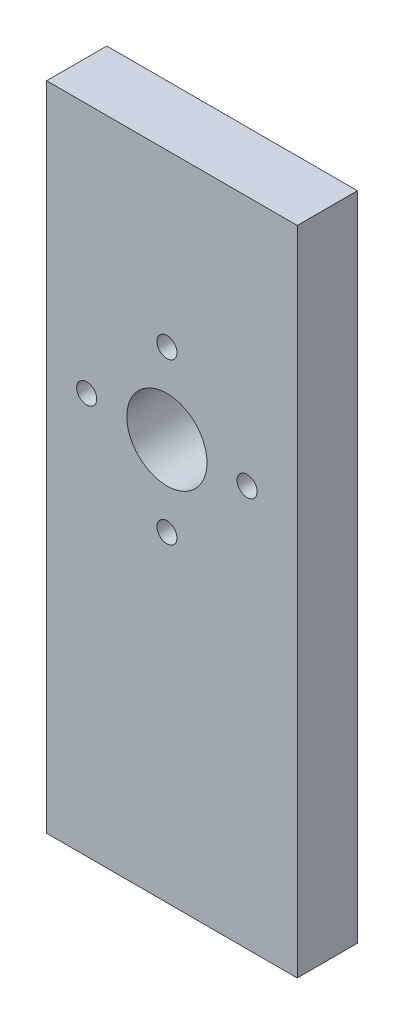
ISO-10303-21;
HEADER;
FILE_DESCRIPTION(('STEP AP214'),'2;1');
FILE_NAME('part.step','',(''),(''),'','','');
FILE_SCHEMA(('AUTOMOTIVE_DESIGN { 1 0 10303 214 1 1 1 1 }'));
ENDSEC;
DATA;
#1=APPLICATION_CONTEXT('core data for automotive mechanical design processes');
#2=APPLICATION_PROTOCOL_DEFINITION('international standard','automotive_design',2000,#1);
#3=PRODUCT_CONTEXT('',#1,'mechanical');
#4=PRODUCT('Part','Part','',(#3));
#5=PRODUCT_RELATED_PRODUCT_CATEGORY('part','',(#4));
#6=PRODUCT_DEFINITION_FORMATION('','',#4);
#7=PRODUCT_DEFINITION_CONTEXT('part definition',#1,'design');
#8=PRODUCT_DEFINITION('design','',#6,#7);
#9=PRODUCT_DEFINITION_SHAPE('','',#8);
#10=(LENGTH_UNIT() NAMED_UNIT(*) SI_UNIT(.MILLI.,.METRE.));
#11=(NAMED_UNIT(*) PLANE_ANGLE_UNIT() SI_UNIT($,.RADIAN.));
#12=(NAMED_UNIT(*) SI_UNIT($,.STERADIAN.) SOLID_ANGLE_UNIT());
#13=UNCERTAINTY_MEASURE_WITH_UNIT(LENGTH_MEASURE(1.E-05),#10,'distance_accuracy_value','');
#14=(GEOMETRIC_REPRESENTATION_CONTEXT(3) GLOBAL_UNCERTAINTY_ASSIGNED_CONTEXT((#13)) GLOBAL_UNIT_ASSIGNED_CONTEXT((#10,
#11,#12)) REPRESENTATION_CONTEXT('',''));
#15=CARTESIAN_POINT('',(0.,0.,0.));
#16=DIRECTION('',(0.,0.,1.));
#17=DIRECTION('',(1.,0.,0.));
#18=AXIS2_PLACEMENT_3D('',#15,#16,#17);
#19=CARTESIAN_POINT('',(0.,0.,6.));
#20=DIRECTION('',(0.,0.,-1.));
#21=DIRECTION('',(-1.,0.,0.));
#22=AXIS2_PLACEMENT_3D('',#19,#20,#21);
#23=PLANE('',#22);
#24=DIRECTION('',(1.,0.,0.));
#25=VECTOR('',#24,1.);
#26=CARTESIAN_POINT('',(50.3645680316484,-115.670745263183,6.));
#27=LINE('',#26,#25);
#28=CARTESIAN_POINT('',(25.3645680316484,-115.670745263183,6.));
#29=VERTEX_POINT('',#28);
#30=CARTESIAN_POINT('',(50.3645680316484,-115.670745263183,6.));
#31=VERTEX_POINT('',#30);
#32=EDGE_CURVE('E85',#29,#31,#27,.T.);
#33=ORIENTED_EDGE('',*,*,#32,.T.);
#34=DIRECTION('',(0.,1.,0.));
#35=VECTOR('',#34,1.);
#36=CARTESIAN_POINT('',(50.3645680316484,-50.6707452631834,6.));
#37=LINE('',#36,#35);
#38=CARTESIAN_POINT('',(50.3645680316484,-50.6707452631834,6.));
#39=VERTEX_POINT('',#38);
#40=EDGE_CURVE('E80',#31,#39,#37,.T.);
#41=ORIENTED_EDGE('',*,*,#40,.T.);
#42=DIRECTION('',(-1.,0.,0.));
#43=VECTOR('',#42,1.);
#44=CARTESIAN_POINT('',(50.3645680316484,-50.6707452631834,6.));
#45=LINE('',#44,#43);
#46=CARTESIAN_POINT('',(25.3645680316484,-50.6707452631833,6.));
#47=VERTEX_POINT('',#46);
#48=EDGE_CURVE('E83',#39,#47,#45,.T.);
#49=ORIENTED_EDGE('',*,*,#48,.T.);
#50=DIRECTION('',(0.,-1.,0.));
#51=VECTOR('',#50,1.);
#52=CARTESIAN_POINT('',(25.3645680316484,-115.670745263183,6.));
#53=LINE('',#52,#51);
#54=EDGE_CURVE('E50',#47,#29,#53,.T.);
#55=ORIENTED_EDGE('',*,*,#54,.T.);
#56=EDGE_LOOP('',(#33,#41,#49,#55));
#57=FACE_BOUND('',#56,.T.);
#58=CARTESIAN_POINT('',(29.3645680316484,-75.6707452631833,6.));
#59=DIRECTION('',(0.,0.,1.));
#60=DIRECTION('',(1.,0.,0.));
#61=AXIS2_PLACEMENT_3D('',#58,#59,#60);
#62=CIRCLE('',#61,1.);
#63=CARTESIAN_POINT('',(30.3645680316484,-75.6707452631833,6.));
#64=VERTEX_POINT('',#63);
#65=EDGE_CURVE('E100',#64,#64,#62,.T.);
#66=ORIENTED_EDGE('',*,*,#65,.F.);
#67=EDGE_LOOP('',(#66));
#68=FACE_BOUND('',#67,.T.);
#69=CARTESIAN_POINT('',(37.3645680316484,-67.6707452631833,6.));
#70=DIRECTION('',(0.,0.,1.));
#71=DIRECTION('',(1.,0.,0.));
#72=AXIS2_PLACEMENT_3D('',#69,#70,#71);
#73=CIRCLE('',#72,0.999999999999998);
#74=CARTESIAN_POINT('',(38.3645680316484,-67.6707452631833,6.));
#75=VERTEX_POINT('',#74);
#76=EDGE_CURVE('E115',#75,#75,#73,.T.);
#77=ORIENTED_EDGE('',*,*,#76,.F.);
#78=EDGE_LOOP('',(#77));
#79=FACE_BOUND('',#78,.T.);
#80=CARTESIAN_POINT('',(45.3645680316484,-75.6707452631833,6.));
#81=DIRECTION('',(0.,0.,1.));
#82=DIRECTION('',(1.,0.,0.));
#83=AXIS2_PLACEMENT_3D('',#80,#81,#82);
#84=CIRCLE('',#83,0.999999999999998);
#85=CARTESIAN_POINT('',(46.3645680316484,-75.6707452631833,6.));
#86=VERTEX_POINT('',#85);
#87=EDGE_CURVE('E121',#86,#86,#84,.T.);
#88=ORIENTED_EDGE('',*,*,#87,.F.);
#89=EDGE_LOOP('',(#88));
#90=FACE_BOUND('',#89,.T.);
#91=CARTESIAN_POINT('',(37.3645680316484,-83.6707452631834,6.));
#92=DIRECTION('',(0.,0.,1.));
#93=DIRECTION('',(1.,0.,0.));
#94=AXIS2_PLACEMENT_3D('',#91,#92,#93);
#95=CIRCLE('',#94,0.999999999999998);
#96=CARTESIAN_POINT('',(38.3645680316484,-83.6707452631834,6.));
#97=VERTEX_POINT('',#96);
#98=EDGE_CURVE('E127',#97,#97,#95,.T.);
#99=ORIENTED_EDGE('',*,*,#98,.F.);
#100=EDGE_LOOP('',(#99));
#101=FACE_BOUND('',#100,.T.);
#102=CARTESIAN_POINT('',(37.3645680316484,-75.6707452631833,6.));
#103=DIRECTION('',(0.,0.,1.));
#104=DIRECTION('',(1.,0.,0.));
#105=AXIS2_PLACEMENT_3D('',#102,#103,#104);
#106=CIRCLE('',#105,4.00000000000001);
#107=CARTESIAN_POINT('',(41.3645680316484,-75.6707452631833,6.));
#108=VERTEX_POINT('',#107);
#109=EDGE_CURVE('E133',#108,#108,#106,.T.);
#110=ORIENTED_EDGE('',*,*,#109,.F.);
#111=EDGE_LOOP('',(#110));
#112=FACE_BOUND('',#111,.T.);
#113=ADVANCED_FACE('F33',(#57,#68,#79,#90,#101,#112),#23,.F.);
#114=CARTESIAN_POINT('',(0.,0.,0.));
#115=DIRECTION('',(0.,0.,-1.));
#116=DIRECTION('',(-1.,0.,0.));
#117=AXIS2_PLACEMENT_3D('',#114,#115,#116);
#118=PLANE('',#117);
#119=CARTESIAN_POINT('',(37.3645680316484,-83.6707452631834,0.));
#120=DIRECTION('',(0.,0.,1.));
#121=DIRECTION('',(1.,0.,0.));
#122=AXIS2_PLACEMENT_3D('',#119,#120,#121);
#123=CIRCLE('',#122,0.999999999999998);
#124=CARTESIAN_POINT('',(38.3645680316484,-83.6707452631834,0.));
#125=VERTEX_POINT('',#124);
#126=EDGE_CURVE('E130',#125,#125,#123,.T.);
#127=ORIENTED_EDGE('',*,*,#126,.T.);
#128=EDGE_LOOP('',(#127));
#129=FACE_BOUND('',#128,.T.);
#130=CARTESIAN_POINT('',(37.3645680316484,-67.6707452631833,0.));
#131=DIRECTION('',(0.,0.,1.));
#132=DIRECTION('',(1.,0.,0.));
#133=AXIS2_PLACEMENT_3D('',#130,#131,#132);
#134=CIRCLE('',#133,0.999999999999998);
#135=CARTESIAN_POINT('',(38.3645680316484,-67.6707452631833,0.));
#136=VERTEX_POINT('',#135);
#137=EDGE_CURVE('E118',#136,#136,#134,.T.);
#138=ORIENTED_EDGE('',*,*,#137,.T.);
#139=EDGE_LOOP('',(#138));
#140=FACE_BOUND('',#139,.T.);
#141=DIRECTION('',(1.,0.,0.));
#142=VECTOR('',#141,1.);
#143=CARTESIAN_POINT('',(50.3645680316484,-115.670745263183,0.));
#144=LINE('',#143,#142);
#145=CARTESIAN_POINT('',(25.3645680316484,-115.670745263183,0.));
#146=VERTEX_POINT('',#145);
#147=CARTESIAN_POINT('',(50.3645680316484,-115.670745263183,0.));
#148=VERTEX_POINT('',#147);
#149=EDGE_CURVE('E97',#146,#148,#144,.T.);
#150=ORIENTED_EDGE('',*,*,#149,.F.);
#151=DIRECTION('',(0.,-1.,0.));
#152=VECTOR('',#151,1.);
#153=CARTESIAN_POINT('',(25.3645680316484,-115.670745263183,0.));
#154=LINE('',#153,#152);
#155=CARTESIAN_POINT('',(25.3645680316484,-50.6707452631833,0.));
#156=VERTEX_POINT('',#155);
#157=EDGE_CURVE('E73',#156,#146,#154,.T.);
#158=ORIENTED_EDGE('',*,*,#157,.F.);
#159=DIRECTION('',(-1.,0.,0.));
#160=VECTOR('',#159,1.);
#161=CARTESIAN_POINT('',(50.3645680316484,-50.6707452631834,0.));
#162=LINE('',#161,#160);
#163=CARTESIAN_POINT('',(50.3645680316484,-50.6707452631834,0.));
#164=VERTEX_POINT('',#163);
#165=EDGE_CURVE('E67',#164,#156,#162,.T.);
#166=ORIENTED_EDGE('',*,*,#165,.F.);
#167=DIRECTION('',(0.,1.,0.));
#168=VECTOR('',#167,1.);
#169=CARTESIAN_POINT('',(50.3645680316484,-50.6707452631834,0.));
#170=LINE('',#169,#168);
#171=EDGE_CURVE('E89',#148,#164,#170,.T.);
#172=ORIENTED_EDGE('',*,*,#171,.F.);
#173=EDGE_LOOP('',(#150,#158,#166,#172));
#174=FACE_BOUND('',#173,.T.);
#175=CARTESIAN_POINT('',(29.3645680316484,-75.6707452631833,0.));
#176=DIRECTION('',(0.,0.,1.));
#177=DIRECTION('',(1.,0.,0.));
#178=AXIS2_PLACEMENT_3D('',#175,#176,#177);
#179=CIRCLE('',#178,1.);
#180=CARTESIAN_POINT('',(30.3645680316484,-75.6707452631833,0.));
#181=VERTEX_POINT('',#180);
#182=EDGE_CURVE('E112',#181,#181,#179,.T.);
#183=ORIENTED_EDGE('',*,*,#182,.T.);
#184=EDGE_LOOP('',(#183));
#185=FACE_BOUND('',#184,.T.);
#186=CARTESIAN_POINT('',(45.3645680316484,-75.6707452631833,0.));
#187=DIRECTION('',(0.,0.,1.));
#188=DIRECTION('',(1.,0.,0.));
#189=AXIS2_PLACEMENT_3D('',#186,#187,#188);
#190=CIRCLE('',#189,0.999999999999998);
#191=CARTESIAN_POINT('',(46.3645680316484,-75.6707452631833,0.));
#192=VERTEX_POINT('',#191);
#193=EDGE_CURVE('E124',#192,#192,#190,.T.);
#194=ORIENTED_EDGE('',*,*,#193,.T.);
#195=EDGE_LOOP('',(#194));
#196=FACE_BOUND('',#195,.T.);
#197=CARTESIAN_POINT('',(37.3645680316484,-75.6707452631833,0.));
#198=DIRECTION('',(0.,0.,1.));
#199=DIRECTION('',(1.,0.,0.));
#200=AXIS2_PLACEMENT_3D('',#197,#198,#199);
#201=CIRCLE('',#200,4.00000000000001);
#202=CARTESIAN_POINT('',(41.3645680316484,-75.6707452631833,0.));
#203=VERTEX_POINT('',#202);
#204=EDGE_CURVE('E136',#203,#203,#201,.T.);
#205=ORIENTED_EDGE('',*,*,#204,.T.);
#206=EDGE_LOOP('',(#205));
#207=FACE_BOUND('',#206,.T.);
#208=ADVANCED_FACE('F108',(#129,#140,#174,#185,#196,#207),#118,.T.);
#209=CARTESIAN_POINT('',(50.3645680316484,-115.670745263183,6.));
#210=DIRECTION('',(0.,1.,0.));
#211=DIRECTION('',(-1.,0.,0.));
#212=AXIS2_PLACEMENT_3D('',#209,#210,#211);
#213=PLANE('',#212);
#214=ORIENTED_EDGE('',*,*,#149,.T.);
#215=DIRECTION('',(0.,0.,-1.));
#216=VECTOR('',#215,1.);
#217=CARTESIAN_POINT('',(50.3645680316484,-115.670745263183,6.));
#218=LINE('',#217,#216);
#219=EDGE_CURVE('E11',#31,#148,#218,.T.);
#220=ORIENTED_EDGE('',*,*,#219,.F.);
#221=ORIENTED_EDGE('',*,*,#32,.F.);
#222=DIRECTION('',(0.,0.,-1.));
#223=VECTOR('',#222,1.);
#224=CARTESIAN_POINT('',(25.3645680316484,-115.670745263183,6.));
#225=LINE('',#224,#223);
#226=EDGE_CURVE('E93',#29,#146,#225,.T.);
#227=ORIENTED_EDGE('',*,*,#226,.T.);
#228=EDGE_LOOP('',(#214,#220,#221,#227));
#229=FACE_BOUND('',#228,.T.);
#230=ADVANCED_FACE('F35',(#229),#213,.F.);
#231=CARTESIAN_POINT('',(50.3645680316484,-50.6707452631834,6.));
#232=DIRECTION('',(-1.,0.,0.));
#233=DIRECTION('',(0.,-1.,0.));
#234=AXIS2_PLACEMENT_3D('',#231,#232,#233);
#235=PLANE('',#234);
#236=ORIENTED_EDGE('',*,*,#171,.T.);
#237=DIRECTION('',(0.,0.,-1.));
#238=VECTOR('',#237,1.);
#239=CARTESIAN_POINT('',(50.3645680316484,-50.6707452631834,6.));
#240=LINE('',#239,#238);
#241=EDGE_CURVE('E42',#39,#164,#240,.T.);
#242=ORIENTED_EDGE('',*,*,#241,.F.);
#243=ORIENTED_EDGE('',*,*,#40,.F.);
#244=ORIENTED_EDGE('',*,*,#219,.T.);
#245=EDGE_LOOP('',(#236,#242,#243,#244));
#246=FACE_BOUND('',#245,.T.);
#247=ADVANCED_FACE('F88',(#246),#235,.F.);
#248=CARTESIAN_POINT('',(50.3645680316484,-50.6707452631834,6.));
#249=DIRECTION('',(0.,-1.,0.));
#250=DIRECTION('',(1.,0.,0.));
#251=AXIS2_PLACEMENT_3D('',#248,#249,#250);
#252=PLANE('',#251);
#253=ORIENTED_EDGE('',*,*,#165,.T.);
#254=DIRECTION('',(0.,0.,-1.));
#255=VECTOR('',#254,1.);
#256=CARTESIAN_POINT('',(25.3645680316484,-50.6707452631833,6.));
#257=LINE('',#256,#255);
#258=EDGE_CURVE('E90',#47,#156,#257,.T.);
#259=ORIENTED_EDGE('',*,*,#258,.F.);
#260=ORIENTED_EDGE('',*,*,#48,.F.);
#261=ORIENTED_EDGE('',*,*,#241,.T.);
#262=EDGE_LOOP('',(#253,#259,#260,#261));
#263=FACE_BOUND('',#262,.T.);
#264=ADVANCED_FACE('F91',(#263),#252,.F.);
#265=CARTESIAN_POINT('',(25.3645680316484,-115.670745263183,6.));
#266=DIRECTION('',(1.,0.,0.));
#267=DIRECTION('',(0.,1.,0.));
#268=AXIS2_PLACEMENT_3D('',#265,#266,#267);
#269=PLANE('',#268);
#270=CARTESIAN_POINT('',(25.3645680316483,-110.670745263183,3.));
#271=DIRECTION('',(-1.,0.,0.));
#272=DIRECTION('',(0.,-1.,0.));
#273=AXIS2_PLACEMENT_3D('',#270,#271,#272);
#274=CIRCLE('',#273,1.5);
#275=CARTESIAN_POINT('',(25.3645680316483,-112.170745263183,3.));
#276=VERTEX_POINT('',#275);
#277=EDGE_CURVE('E148',#276,#276,#274,.T.);
#278=ORIENTED_EDGE('',*,*,#277,.F.);
#279=EDGE_LOOP('',(#278));
#280=FACE_BOUND('',#279,.T.);
#281=CARTESIAN_POINT('',(25.3645680316484,-55.6707452631833,3.));
#282=DIRECTION('',(-1.,0.,0.));
#283=DIRECTION('',(0.,-1.,0.));
#284=AXIS2_PLACEMENT_3D('',#281,#282,#283);
#285=CIRCLE('',#284,1.5);
#286=CARTESIAN_POINT('',(25.3645680316484,-57.1707452631833,3.));
#287=VERTEX_POINT('',#286);
#288=EDGE_CURVE('E142',#287,#287,#285,.T.);
#289=ORIENTED_EDGE('',*,*,#288,.F.);
#290=EDGE_LOOP('',(#289));
#291=FACE_BOUND('',#290,.T.);
#292=ORIENTED_EDGE('',*,*,#157,.T.);
#293=ORIENTED_EDGE('',*,*,#226,.F.);
#294=ORIENTED_EDGE('',*,*,#54,.F.);
#295=ORIENTED_EDGE('',*,*,#258,.T.);
#296=EDGE_LOOP('',(#292,#293,#294,#295));
#297=FACE_BOUND('',#296,.T.);
#298=ADVANCED_FACE('F105',(#280,#291,#297),#269,.F.);
#299=CARTESIAN_POINT('',(29.3645680316484,-75.6707452631833,6.));
#300=DIRECTION('',(0.,0.,-1.));
#301=DIRECTION('',(-1.,0.,0.));
#302=AXIS2_PLACEMENT_3D('',#299,#300,#301);
#303=CYLINDRICAL_SURFACE('',#302,1.);
#304=ORIENTED_EDGE('',*,*,#65,.T.);
#305=EDGE_LOOP('',(#304));
#306=FACE_BOUND('',#305,.T.);
#307=ORIENTED_EDGE('',*,*,#182,.F.);
#308=EDGE_LOOP('',(#307));
#309=FACE_BOUND('',#308,.T.);
#310=ADVANCED_FACE('F165',(#306,#309),#303,.F.);
#311=CARTESIAN_POINT('',(37.3645680316484,-67.6707452631833,6.));
#312=DIRECTION('',(0.,0.,-1.));
#313=DIRECTION('',(-1.,0.,0.));
#314=AXIS2_PLACEMENT_3D('',#311,#312,#313);
#315=CYLINDRICAL_SURFACE('',#314,0.999999999999998);
#316=ORIENTED_EDGE('',*,*,#76,.T.);
#317=EDGE_LOOP('',(#316));
#318=FACE_BOUND('',#317,.T.);
#319=ORIENTED_EDGE('',*,*,#137,.F.);
#320=EDGE_LOOP('',(#319));
#321=FACE_BOUND('',#320,.T.);
#322=ADVANCED_FACE('F236',(#318,#321),#315,.F.);
#323=CARTESIAN_POINT('',(45.3645680316484,-75.6707452631833,6.));
#324=DIRECTION('',(0.,0.,-1.));
#325=DIRECTION('',(-1.,0.,0.));
#326=AXIS2_PLACEMENT_3D('',#323,#324,#325);
#327=CYLINDRICAL_SURFACE('',#326,0.999999999999998);
#328=ORIENTED_EDGE('',*,*,#87,.T.);
#329=EDGE_LOOP('',(#328));
#330=FACE_BOUND('',#329,.T.);
#331=ORIENTED_EDGE('',*,*,#193,.F.);
#332=EDGE_LOOP('',(#331));
#333=FACE_BOUND('',#332,.T.);
#334=ADVANCED_FACE('F244',(#330,#333),#327,.F.);
#335=CARTESIAN_POINT('',(37.3645680316484,-83.6707452631834,6.));
#336=DIRECTION('',(0.,0.,-1.));
#337=DIRECTION('',(-1.,0.,0.));
#338=AXIS2_PLACEMENT_3D('',#335,#336,#337);
#339=CYLINDRICAL_SURFACE('',#338,0.999999999999998);
#340=ORIENTED_EDGE('',*,*,#98,.T.);
#341=EDGE_LOOP('',(#340));
#342=FACE_BOUND('',#341,.T.);
#343=ORIENTED_EDGE('',*,*,#126,.F.);
#344=EDGE_LOOP('',(#343));
#345=FACE_BOUND('',#344,.T.);
#346=ADVANCED_FACE('F180',(#342,#345),#339,.F.);
#347=CARTESIAN_POINT('',(37.3645680316484,-75.6707452631833,6.));
#348=DIRECTION('',(0.,0.,-1.));
#349=DIRECTION('',(-1.,0.,0.));
#350=AXIS2_PLACEMENT_3D('',#347,#348,#349);
#351=CYLINDRICAL_SURFACE('',#350,4.00000000000001);
#352=ORIENTED_EDGE('',*,*,#109,.T.);
#353=EDGE_LOOP('',(#352));
#354=FACE_BOUND('',#353,.T.);
#355=ORIENTED_EDGE('',*,*,#204,.F.);
#356=EDGE_LOOP('',(#355));
#357=FACE_BOUND('',#356,.T.);
#358=ADVANCED_FACE('F171',(#354,#357),#351,.F.);
#359=CARTESIAN_POINT('',(35.3645680316484,-55.6707452631833,3.));
#360=DIRECTION('',(-1.,0.,0.));
#361=DIRECTION('',(0.,-1.,0.));
#362=AXIS2_PLACEMENT_3D('',#359,#360,#361);
#363=CYLINDRICAL_SURFACE('',#362,1.5);
#364=CARTESIAN_POINT('',(35.3645680316484,-55.6707452631833,3.));
#365=DIRECTION('',(-1.,0.,0.));
#366=DIRECTION('',(0.,-1.,0.));
#367=AXIS2_PLACEMENT_3D('',#364,#365,#366);
#368=CIRCLE('',#367,1.5);
#369=CARTESIAN_POINT('',(35.3645680316484,-57.1707452631833,3.));
#370=VERTEX_POINT('',#369);
#371=EDGE_CURVE('E139',#370,#370,#368,.T.);
#372=ORIENTED_EDGE('',*,*,#371,.F.);
#373=EDGE_LOOP('',(#372));
#374=FACE_BOUND('',#373,.T.);
#375=ORIENTED_EDGE('',*,*,#288,.T.);
#376=EDGE_LOOP('',(#375));
#377=FACE_BOUND('',#376,.T.);
#378=ADVANCED_FACE('F169',(#374,#377),#363,.F.);
#379=CARTESIAN_POINT('',(35.3645680316484,-55.6707452631833,3.));
#380=DIRECTION('',(-1.,0.,0.));
#381=DIRECTION('',(0.,-1.,0.));
#382=AXIS2_PLACEMENT_3D('',#379,#380,#381);
#383=PLANE('',#382);
#384=ORIENTED_EDGE('',*,*,#371,.T.);
#385=EDGE_LOOP('',(#384));
#386=FACE_BOUND('',#385,.T.);
#387=ADVANCED_FACE('F159',(#386),#383,.T.);
#388=CARTESIAN_POINT('',(35.3645680316483,-110.670745263183,3.));
#389=DIRECTION('',(-1.,0.,0.));
#390=DIRECTION('',(0.,-1.,0.));
#391=AXIS2_PLACEMENT_3D('',#388,#389,#390);
#392=CYLINDRICAL_SURFACE('',#391,1.5);
#393=CARTESIAN_POINT('',(35.3645680316483,-110.670745263183,3.));
#394=DIRECTION('',(-1.,0.,0.));
#395=DIRECTION('',(0.,-1.,0.));
#396=AXIS2_PLACEMENT_3D('',#393,#394,#395);
#397=CIRCLE('',#396,1.5);
#398=CARTESIAN_POINT('',(35.3645680316483,-112.170745263183,3.));
#399=VERTEX_POINT('',#398);
#400=EDGE_CURVE('E145',#399,#399,#397,.T.);
#401=ORIENTED_EDGE('',*,*,#400,.F.);
#402=EDGE_LOOP('',(#401));
#403=FACE_BOUND('',#402,.T.);
#404=ORIENTED_EDGE('',*,*,#277,.T.);
#405=EDGE_LOOP('',(#404));
#406=FACE_BOUND('',#405,.T.);
#407=ADVANCED_FACE('F156',(#403,#406),#392,.F.);
#408=CARTESIAN_POINT('',(35.3645680316483,-110.670745263183,3.));
#409=DIRECTION('',(-1.,0.,0.));
#410=DIRECTION('',(0.,-1.,0.));
#411=AXIS2_PLACEMENT_3D('',#408,#409,#410);
#412=PLANE('',#411);
#413=ORIENTED_EDGE('',*,*,#400,.T.);
#414=EDGE_LOOP('',(#413));
#415=FACE_BOUND('',#414,.T.);
#416=ADVANCED_FACE('F154',(#415),#412,.T.);
#417=CLOSED_SHELL('',(#113,#208,#230,#247,#264,#298,#310,#322,#334,#346,#358,#378,#387,#407,#416));
#418=MANIFOLD_SOLID_BREP('B2',#417);
#419=ADVANCED_BREP_SHAPE_REPRESENTATION('',(#18,#418),#14);
#420=SHAPE_DEFINITION_REPRESENTATION(#9,#419);
ENDSEC;
END-ISO-10303-21;
